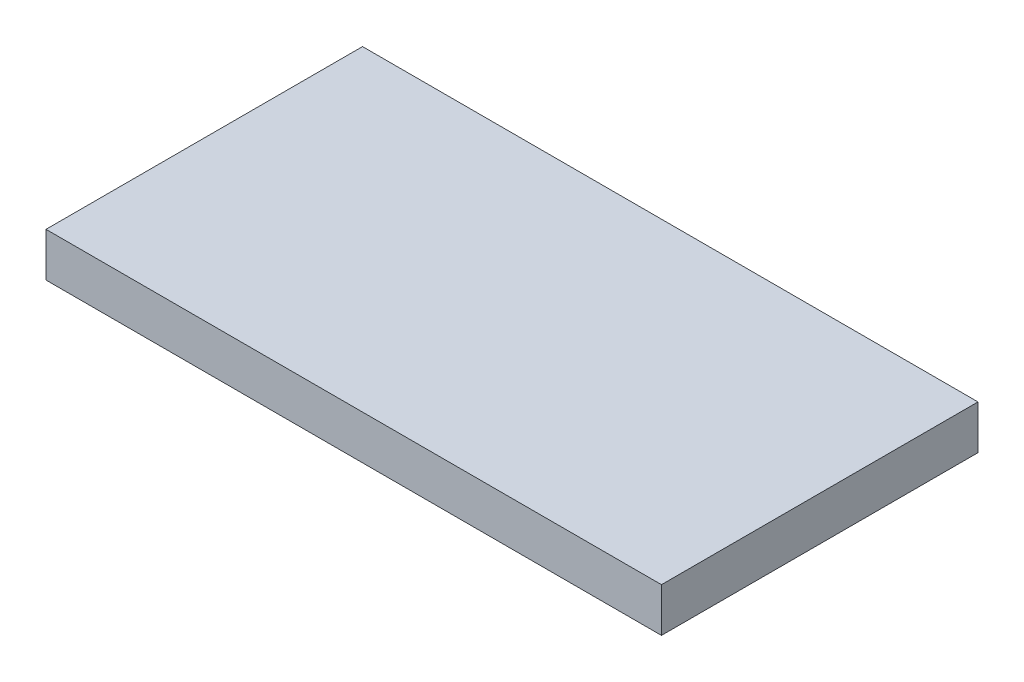
ISO-10303-21;
HEADER;
FILE_DESCRIPTION(('STEP AP214'),'2;1');
FILE_NAME('part.step','',(''),(''),'','','');
FILE_SCHEMA(('AUTOMOTIVE_DESIGN { 1 0 10303 214 1 1 1 1 }'));
ENDSEC;
DATA;
#1=APPLICATION_CONTEXT('core data for automotive mechanical design processes');
#2=APPLICATION_PROTOCOL_DEFINITION('international standard','automotive_design',2000,#1);
#3=PRODUCT_CONTEXT('',#1,'mechanical');
#4=PRODUCT('Part','Part','',(#3));
#5=PRODUCT_RELATED_PRODUCT_CATEGORY('part','',(#4));
#6=PRODUCT_DEFINITION_FORMATION('','',#4);
#7=PRODUCT_DEFINITION_CONTEXT('part definition',#1,'design');
#8=PRODUCT_DEFINITION('design','',#6,#7);
#9=PRODUCT_DEFINITION_SHAPE('','',#8);
#10=(LENGTH_UNIT() NAMED_UNIT(*) SI_UNIT(.MILLI.,.METRE.));
#11=(NAMED_UNIT(*) PLANE_ANGLE_UNIT() SI_UNIT($,.RADIAN.));
#12=(NAMED_UNIT(*) SI_UNIT($,.STERADIAN.) SOLID_ANGLE_UNIT());
#13=UNCERTAINTY_MEASURE_WITH_UNIT(LENGTH_MEASURE(1.E-05),#10,'distance_accuracy_value','');
#14=(GEOMETRIC_REPRESENTATION_CONTEXT(3) GLOBAL_UNCERTAINTY_ASSIGNED_CONTEXT((#13)) GLOBAL_UNIT_ASSIGNED_CONTEXT((#10,
#11,#12)) REPRESENTATION_CONTEXT('',''));
#15=CARTESIAN_POINT('',(0.,0.,0.));
#16=DIRECTION('',(0.,0.,1.));
#17=DIRECTION('',(1.,0.,0.));
#18=AXIS2_PLACEMENT_3D('',#15,#16,#17);
#19=CARTESIAN_POINT('',(22.225,1.5875,11.43));
#20=DIRECTION('',(-1.,0.,0.));
#21=DIRECTION('',(0.,0.,1.));
#22=AXIS2_PLACEMENT_3D('',#19,#20,#21);
#23=PLANE('',#22);
#24=DIRECTION('',(0.,0.,-1.));
#25=VECTOR('',#24,1.);
#26=CARTESIAN_POINT('',(22.225,-1.5875,11.43));
#27=LINE('',#26,#25);
#28=CARTESIAN_POINT('',(22.225,-1.5875,11.43));
#29=VERTEX_POINT('',#28);
#30=CARTESIAN_POINT('',(22.225,-1.5875,-11.43));
#31=VERTEX_POINT('',#30);
#32=EDGE_CURVE('E107',#29,#31,#27,.T.);
#33=ORIENTED_EDGE('',*,*,#32,.T.);
#34=DIRECTION('',(0.,-1.,0.));
#35=VECTOR('',#34,1.);
#36=CARTESIAN_POINT('',(22.225,1.5875,-11.43));
#37=LINE('',#36,#35);
#38=CARTESIAN_POINT('',(22.225,1.5875,-11.43));
#39=VERTEX_POINT('',#38);
#40=EDGE_CURVE('E11',#39,#31,#37,.T.);
#41=ORIENTED_EDGE('',*,*,#40,.F.);
#42=DIRECTION('',(0.,0.,-1.));
#43=VECTOR('',#42,1.);
#44=CARTESIAN_POINT('',(22.225,1.5875,11.43));
#45=LINE('',#44,#43);
#46=CARTESIAN_POINT('',(22.225,1.5875,11.43));
#47=VERTEX_POINT('',#46);
#48=EDGE_CURVE('E91',#47,#39,#45,.T.);
#49=ORIENTED_EDGE('',*,*,#48,.F.);
#50=DIRECTION('',(0.,-1.,0.));
#51=VECTOR('',#50,1.);
#52=CARTESIAN_POINT('',(22.225,1.5875,11.43));
#53=LINE('',#52,#51);
#54=EDGE_CURVE('E103',#47,#29,#53,.T.);
#55=ORIENTED_EDGE('',*,*,#54,.T.);
#56=EDGE_LOOP('',(#33,#41,#49,#55));
#57=FACE_BOUND('',#56,.T.);
#58=ADVANCED_FACE('F39',(#57),#23,.F.);
#59=CARTESIAN_POINT('',(-22.225,1.5875,-11.43));
#60=DIRECTION('',(0.,0.,1.));
#61=DIRECTION('',(1.,0.,0.));
#62=AXIS2_PLACEMENT_3D('',#59,#60,#61);
#63=PLANE('',#62);
#64=DIRECTION('',(-1.,0.,0.));
#65=VECTOR('',#64,1.);
#66=CARTESIAN_POINT('',(-22.225,-1.5875,-11.43));
#67=LINE('',#66,#65);
#68=CARTESIAN_POINT('',(-22.225,-1.5875,-11.43));
#69=VERTEX_POINT('',#68);
#70=EDGE_CURVE('E96',#31,#69,#67,.T.);
#71=ORIENTED_EDGE('',*,*,#70,.T.);
#72=DIRECTION('',(0.,-1.,0.));
#73=VECTOR('',#72,1.);
#74=CARTESIAN_POINT('',(-22.225,1.5875,-11.43));
#75=LINE('',#74,#73);
#76=CARTESIAN_POINT('',(-22.225,1.5875,-11.43));
#77=VERTEX_POINT('',#76);
#78=EDGE_CURVE('E48',#77,#69,#75,.T.);
#79=ORIENTED_EDGE('',*,*,#78,.F.);
#80=DIRECTION('',(-1.,0.,0.));
#81=VECTOR('',#80,1.);
#82=CARTESIAN_POINT('',(-22.225,1.5875,-11.43));
#83=LINE('',#82,#81);
#84=EDGE_CURVE('E86',#39,#77,#83,.T.);
#85=ORIENTED_EDGE('',*,*,#84,.F.);
#86=ORIENTED_EDGE('',*,*,#40,.T.);
#87=EDGE_LOOP('',(#71,#79,#85,#86));
#88=FACE_BOUND('',#87,.T.);
#89=ADVANCED_FACE('F95',(#88),#63,.F.);
#90=CARTESIAN_POINT('',(-22.225,1.5875,11.43));
#91=DIRECTION('',(1.,0.,0.));
#92=DIRECTION('',(0.,0.,-1.));
#93=AXIS2_PLACEMENT_3D('',#90,#91,#92);
#94=PLANE('',#93);
#95=DIRECTION('',(0.,0.,1.));
#96=VECTOR('',#95,1.);
#97=CARTESIAN_POINT('',(-22.225,-1.5875,11.43));
#98=LINE('',#97,#96);
#99=CARTESIAN_POINT('',(-22.225,-1.5875,11.43));
#100=VERTEX_POINT('',#99);
#101=EDGE_CURVE('E73',#69,#100,#98,.T.);
#102=ORIENTED_EDGE('',*,*,#101,.T.);
#103=DIRECTION('',(0.,-1.,0.));
#104=VECTOR('',#103,1.);
#105=CARTESIAN_POINT('',(-22.225,1.5875,11.43));
#106=LINE('',#105,#104);
#107=CARTESIAN_POINT('',(-22.225,1.5875,11.43));
#108=VERTEX_POINT('',#107);
#109=EDGE_CURVE('E98',#108,#100,#106,.T.);
#110=ORIENTED_EDGE('',*,*,#109,.F.);
#111=DIRECTION('',(0.,0.,1.));
#112=VECTOR('',#111,1.);
#113=CARTESIAN_POINT('',(-22.225,1.5875,11.43));
#114=LINE('',#113,#112);
#115=EDGE_CURVE('E89',#77,#108,#114,.T.);
#116=ORIENTED_EDGE('',*,*,#115,.F.);
#117=ORIENTED_EDGE('',*,*,#78,.T.);
#118=EDGE_LOOP('',(#102,#110,#116,#117));
#119=FACE_BOUND('',#118,.T.);
#120=ADVANCED_FACE('F99',(#119),#94,.F.);
#121=CARTESIAN_POINT('',(-22.225,1.5875,11.43));
#122=DIRECTION('',(0.,0.,-1.));
#123=DIRECTION('',(-1.,0.,0.));
#124=AXIS2_PLACEMENT_3D('',#121,#122,#123);
#125=PLANE('',#124);
#126=DIRECTION('',(1.,0.,0.));
#127=VECTOR('',#126,1.);
#128=CARTESIAN_POINT('',(-22.225,-1.5875,11.43));
#129=LINE('',#128,#127);
#130=EDGE_CURVE('E79',#100,#29,#129,.T.);
#131=ORIENTED_EDGE('',*,*,#130,.T.);
#132=ORIENTED_EDGE('',*,*,#54,.F.);
#133=DIRECTION('',(1.,0.,0.));
#134=VECTOR('',#133,1.);
#135=CARTESIAN_POINT('',(-22.225,1.5875,11.43));
#136=LINE('',#135,#134);
#137=EDGE_CURVE('E56',#108,#47,#136,.T.);
#138=ORIENTED_EDGE('',*,*,#137,.F.);
#139=ORIENTED_EDGE('',*,*,#109,.T.);
#140=EDGE_LOOP('',(#131,#132,#138,#139));
#141=FACE_BOUND('',#140,.T.);
#142=ADVANCED_FACE('F120',(#141),#125,.F.);
#143=CARTESIAN_POINT('',(0.,1.5875,0.));
#144=DIRECTION('',(0.,-1.,0.));
#145=DIRECTION('',(0.,0.,-1.));
#146=AXIS2_PLACEMENT_3D('',#143,#144,#145);
#147=PLANE('',#146);
#148=ORIENTED_EDGE('',*,*,#48,.T.);
#149=ORIENTED_EDGE('',*,*,#84,.T.);
#150=ORIENTED_EDGE('',*,*,#115,.T.);
#151=ORIENTED_EDGE('',*,*,#137,.T.);
#152=EDGE_LOOP('',(#148,#149,#150,#151));
#153=FACE_BOUND('',#152,.T.);
#154=ADVANCED_FACE('F87',(#153),#147,.F.);
#155=CARTESIAN_POINT('',(0.,-1.5875,0.));
#156=DIRECTION('',(0.,-1.,0.));
#157=DIRECTION('',(0.,0.,-1.));
#158=AXIS2_PLACEMENT_3D('',#155,#156,#157);
#159=PLANE('',#158);
#160=ORIENTED_EDGE('',*,*,#32,.F.);
#161=ORIENTED_EDGE('',*,*,#130,.F.);
#162=ORIENTED_EDGE('',*,*,#101,.F.);
#163=ORIENTED_EDGE('',*,*,#70,.F.);
#164=EDGE_LOOP('',(#160,#161,#162,#163));
#165=FACE_BOUND('',#164,.T.);
#166=ADVANCED_FACE('F123',(#165),#159,.T.);
#167=CLOSED_SHELL('',(#58,#89,#120,#142,#154,#166));
#168=MANIFOLD_SOLID_BREP('B2',#167);
#169=ADVANCED_BREP_SHAPE_REPRESENTATION('',(#18,#168),#14);
#170=SHAPE_DEFINITION_REPRESENTATION(#9,#169);
ENDSEC;
END-ISO-10303-21;
